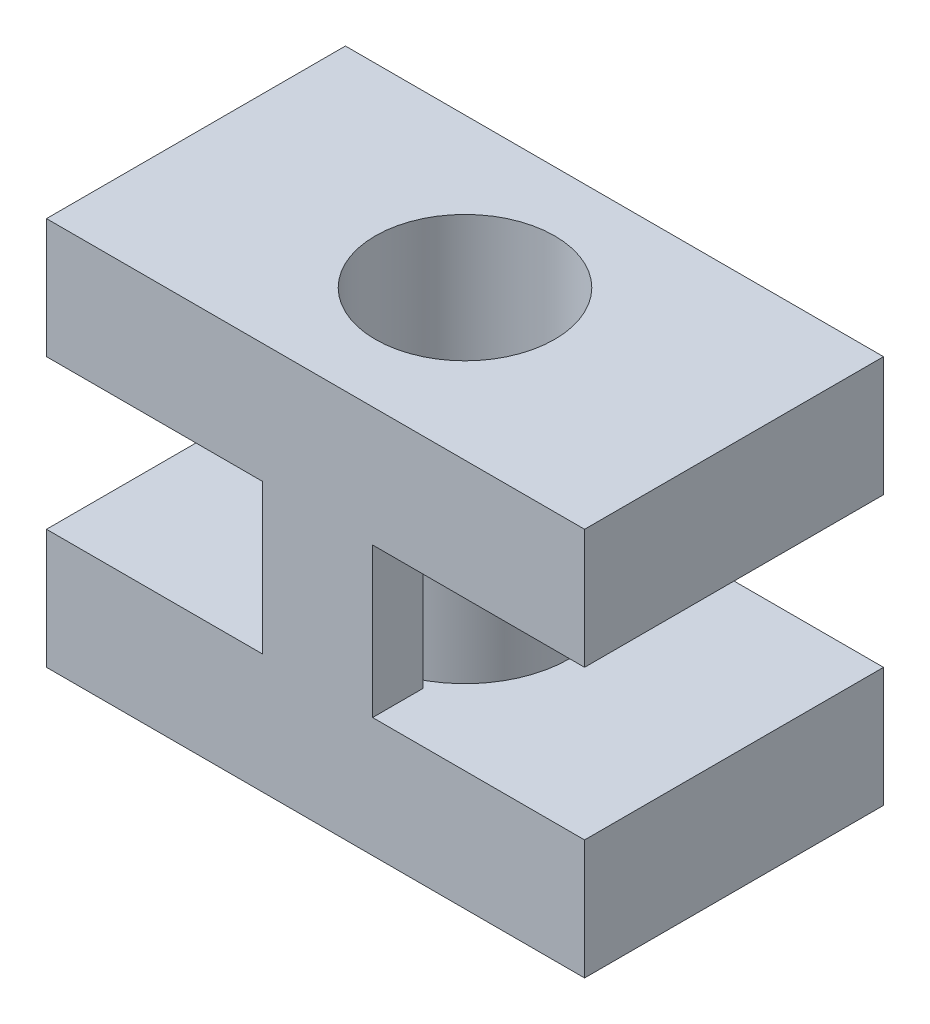
ISO-10303-21;
HEADER;
FILE_DESCRIPTION(('STEP AP214'),'2;1');
FILE_NAME('part.step','',(''),(''),'','','');
FILE_SCHEMA(('AUTOMOTIVE_DESIGN { 1 0 10303 214 1 1 1 1 }'));
ENDSEC;
DATA;
#1=APPLICATION_CONTEXT('core data for automotive mechanical design processes');
#2=APPLICATION_PROTOCOL_DEFINITION('international standard','automotive_design',2000,#1);
#3=PRODUCT_CONTEXT('',#1,'mechanical');
#4=PRODUCT('Part','Part','',(#3));
#5=PRODUCT_RELATED_PRODUCT_CATEGORY('part','',(#4));
#6=PRODUCT_DEFINITION_FORMATION('','',#4);
#7=PRODUCT_DEFINITION_CONTEXT('part definition',#1,'design');
#8=PRODUCT_DEFINITION('design','',#6,#7);
#9=PRODUCT_DEFINITION_SHAPE('','',#8);
#10=(LENGTH_UNIT() NAMED_UNIT(*) SI_UNIT(.MILLI.,.METRE.));
#11=(NAMED_UNIT(*) PLANE_ANGLE_UNIT() SI_UNIT($,.RADIAN.));
#12=(NAMED_UNIT(*) SI_UNIT($,.STERADIAN.) SOLID_ANGLE_UNIT());
#13=UNCERTAINTY_MEASURE_WITH_UNIT(LENGTH_MEASURE(1.E-05),#10,'distance_accuracy_value','');
#14=(GEOMETRIC_REPRESENTATION_CONTEXT(3) GLOBAL_UNCERTAINTY_ASSIGNED_CONTEXT((#13)) GLOBAL_UNIT_ASSIGNED_CONTEXT((#10,
#11,#12)) REPRESENTATION_CONTEXT('',''));
#15=CARTESIAN_POINT('',(0.,0.,0.));
#16=DIRECTION('',(0.,0.,1.));
#17=DIRECTION('',(1.,0.,0.));
#18=AXIS2_PLACEMENT_3D('',#15,#16,#17);
#19=CARTESIAN_POINT('',(0.,3.25,0.));
#20=DIRECTION('',(0.,-1.,0.));
#21=DIRECTION('',(0.,0.,-1.));
#22=AXIS2_PLACEMENT_3D('',#19,#20,#21);
#23=CYLINDRICAL_SURFACE('',#22,1.75);
#24=DIRECTION('',(0.,-1.,0.));
#25=VECTOR('',#24,1.);
#26=CARTESIAN_POINT('',(-0.560962770969429,3.25,1.65765520226201));
#27=LINE('',#26,#25);
#28=CARTESIAN_POINT('',(-0.560962770969429,1.25,1.65765520226201));
#29=VERTEX_POINT('',#28);
#30=CARTESIAN_POINT('',(-0.560962770969429,-1.25,1.65765520226201));
#31=VERTEX_POINT('',#30);
#32=EDGE_CURVE('E203',#29,#31,#27,.T.);
#33=ORIENTED_EDGE('',*,*,#32,.F.);
#34=CARTESIAN_POINT('',(0.,1.25,0.));
#35=DIRECTION('',(0.,1.,0.));
#36=DIRECTION('',(0.,0.,1.));
#37=AXIS2_PLACEMENT_3D('',#34,#35,#36);
#38=CIRCLE('',#37,1.75);
#39=CARTESIAN_POINT('',(-0.560962770969429,1.25,-1.65765520226201));
#40=VERTEX_POINT('',#39);
#41=EDGE_CURVE('E302',#40,#29,#38,.T.);
#42=ORIENTED_EDGE('',*,*,#41,.F.);
#43=DIRECTION('',(0.,-1.,0.));
#44=VECTOR('',#43,1.);
#45=CARTESIAN_POINT('',(-0.560962770969429,3.25,-1.65765520226201));
#46=LINE('',#45,#44);
#47=CARTESIAN_POINT('',(-0.560962770969429,-1.25,-1.65765520226201));
#48=VERTEX_POINT('',#47);
#49=EDGE_CURVE('E224',#48,#40,#46,.F.);
#50=ORIENTED_EDGE('',*,*,#49,.F.);
#51=CARTESIAN_POINT('',(0.,-1.25,0.));
#52=DIRECTION('',(0.,-1.,0.));
#53=DIRECTION('',(0.,0.,-1.));
#54=AXIS2_PLACEMENT_3D('',#51,#52,#53);
#55=CIRCLE('',#54,1.75);
#56=EDGE_CURVE('E40',#31,#48,#55,.T.);
#57=ORIENTED_EDGE('',*,*,#56,.F.);
#58=EDGE_LOOP('',(#33,#42,#50,#57));
#59=FACE_BOUND('',#58,.T.);
#60=ADVANCED_FACE('F32',(#59),#23,.T.);
#61=DIRECTION('',(0.,-1.,0.));
#62=VECTOR('',#61,1.);
#63=CARTESIAN_POINT('',(0.560962770969429,3.25,1.65765520226201));
#64=LINE('',#63,#62);
#65=CARTESIAN_POINT('',(0.560962770969429,-1.25,1.65765520226201));
#66=VERTEX_POINT('',#65);
#67=CARTESIAN_POINT('',(0.560962770969429,1.25,1.65765520226201));
#68=VERTEX_POINT('',#67);
#69=EDGE_CURVE('E200',#66,#68,#64,.F.);
#70=ORIENTED_EDGE('',*,*,#69,.F.);
#71=CARTESIAN_POINT('',(0.560962770969429,-1.25,-1.65765520226201));
#72=VERTEX_POINT('',#71);
#73=EDGE_CURVE('E11',#72,#66,#55,.T.);
#74=ORIENTED_EDGE('',*,*,#73,.F.);
#75=DIRECTION('',(0.,-1.,0.));
#76=VECTOR('',#75,1.);
#77=CARTESIAN_POINT('',(0.560962770969429,3.25,-1.65765520226201));
#78=LINE('',#77,#76);
#79=CARTESIAN_POINT('',(0.560962770969429,1.25,-1.65765520226201));
#80=VERTEX_POINT('',#79);
#81=EDGE_CURVE('E239',#80,#72,#78,.T.);
#82=ORIENTED_EDGE('',*,*,#81,.F.);
#83=EDGE_CURVE('E303',#68,#80,#38,.T.);
#84=ORIENTED_EDGE('',*,*,#83,.F.);
#85=EDGE_LOOP('',(#70,#74,#82,#84));
#86=FACE_BOUND('',#85,.T.);
#87=ADVANCED_FACE('F328',(#86),#23,.T.);
#88=CARTESIAN_POINT('',(0.,1.25,0.));
#89=DIRECTION('',(0.,1.,0.));
#90=DIRECTION('',(0.,0.,1.));
#91=AXIS2_PLACEMENT_3D('',#88,#89,#90);
#92=PLANE('',#91);
#93=DIRECTION('',(0.,0.,-1.));
#94=VECTOR('',#93,1.);
#95=CARTESIAN_POINT('',(0.954424960212918,1.25,2.5));
#96=LINE('',#95,#94);
#97=CARTESIAN_POINT('',(0.954424960212918,1.25,2.5));
#98=VERTEX_POINT('',#97);
#99=CARTESIAN_POINT('',(0.954424960212918,1.25,1.65765520226201));
#100=VERTEX_POINT('',#99);
#101=EDGE_CURVE('E48',#98,#100,#96,.T.);
#102=ORIENTED_EDGE('',*,*,#101,.T.);
#103=DIRECTION('',(-1.,0.,0.));
#104=VECTOR('',#103,1.);
#105=CARTESIAN_POINT('',(0.,1.25,1.65765520226201));
#106=LINE('',#105,#104);
#107=EDGE_CURVE('E346',#100,#68,#106,.T.);
#108=ORIENTED_EDGE('',*,*,#107,.T.);
#109=ORIENTED_EDGE('',*,*,#83,.T.);
#110=DIRECTION('',(1.,0.,0.));
#111=VECTOR('',#110,1.);
#112=CARTESIAN_POINT('',(0.,1.25,-1.65765520226201));
#113=LINE('',#112,#111);
#114=CARTESIAN_POINT('',(0.954424960212918,1.25,-1.65765520226201));
#115=VERTEX_POINT('',#114);
#116=EDGE_CURVE('E211',#80,#115,#113,.T.);
#117=ORIENTED_EDGE('',*,*,#116,.T.);
#118=DIRECTION('',(0.,0.,-1.));
#119=VECTOR('',#118,1.);
#120=CARTESIAN_POINT('',(0.954424960212918,1.25,-2.5));
#121=LINE('',#120,#119);
#122=CARTESIAN_POINT('',(0.954424960212918,1.25,-2.5));
#123=VERTEX_POINT('',#122);
#124=EDGE_CURVE('E225',#115,#123,#121,.T.);
#125=ORIENTED_EDGE('',*,*,#124,.T.);
#126=DIRECTION('',(-1.,0.,0.));
#127=VECTOR('',#126,1.);
#128=CARTESIAN_POINT('',(4.5,1.25,-2.5));
#129=LINE('',#128,#127);
#130=CARTESIAN_POINT('',(4.5,1.25,-2.5));
#131=VERTEX_POINT('',#130);
#132=EDGE_CURVE('E281',#131,#123,#129,.T.);
#133=ORIENTED_EDGE('',*,*,#132,.F.);
#134=DIRECTION('',(0.,0.,-1.));
#135=VECTOR('',#134,1.);
#136=CARTESIAN_POINT('',(4.5,1.25,2.5));
#137=LINE('',#136,#135);
#138=CARTESIAN_POINT('',(4.5,1.25,2.5));
#139=VERTEX_POINT('',#138);
#140=EDGE_CURVE('E277',#139,#131,#137,.T.);
#141=ORIENTED_EDGE('',*,*,#140,.F.);
#142=DIRECTION('',(1.,0.,0.));
#143=VECTOR('',#142,1.);
#144=CARTESIAN_POINT('',(4.5,1.25,2.5));
#145=LINE('',#144,#143);
#146=EDGE_CURVE('E272',#98,#139,#145,.T.);
#147=ORIENTED_EDGE('',*,*,#146,.F.);
#148=EDGE_LOOP('',(#102,#108,#109,#117,#125,#133,#141,#147));
#149=FACE_BOUND('',#148,.T.);
#150=ADVANCED_FACE('F333',(#149),#92,.F.);
#151=CARTESIAN_POINT('',(-0.890187656551689,1.25,1.65765520226201));
#152=VERTEX_POINT('',#151);
#153=EDGE_CURVE('E56',#29,#152,#106,.T.);
#154=ORIENTED_EDGE('',*,*,#153,.T.);
#155=DIRECTION('',(0.,0.,1.));
#156=VECTOR('',#155,1.);
#157=CARTESIAN_POINT('',(-0.890187656551689,1.25,1.65765520226201));
#158=LINE('',#157,#156);
#159=CARTESIAN_POINT('',(-0.890187656551689,1.25,2.5));
#160=VERTEX_POINT('',#159);
#161=EDGE_CURVE('E204',#152,#160,#158,.T.);
#162=ORIENTED_EDGE('',*,*,#161,.T.);
#163=CARTESIAN_POINT('',(-4.5,1.25,2.5));
#164=VERTEX_POINT('',#163);
#165=EDGE_CURVE('E274',#164,#160,#145,.T.);
#166=ORIENTED_EDGE('',*,*,#165,.F.);
#167=DIRECTION('',(0.,0.,1.));
#168=VECTOR('',#167,1.);
#169=CARTESIAN_POINT('',(-4.5,1.25,2.5));
#170=LINE('',#169,#168);
#171=CARTESIAN_POINT('',(-4.5,1.25,-2.5));
#172=VERTEX_POINT('',#171);
#173=EDGE_CURVE('E269',#172,#164,#170,.T.);
#174=ORIENTED_EDGE('',*,*,#173,.F.);
#175=CARTESIAN_POINT('',(-0.890187656551689,1.25,-2.5));
#176=VERTEX_POINT('',#175);
#177=EDGE_CURVE('E280',#176,#172,#129,.T.);
#178=ORIENTED_EDGE('',*,*,#177,.F.);
#179=DIRECTION('',(0.,0.,1.));
#180=VECTOR('',#179,1.);
#181=CARTESIAN_POINT('',(-0.890187656551689,1.25,-1.65765520226201));
#182=LINE('',#181,#180);
#183=CARTESIAN_POINT('',(-0.890187656551689,1.25,-1.65765520226201));
#184=VERTEX_POINT('',#183);
#185=EDGE_CURVE('E222',#176,#184,#182,.T.);
#186=ORIENTED_EDGE('',*,*,#185,.T.);
#187=EDGE_CURVE('E227',#184,#40,#113,.T.);
#188=ORIENTED_EDGE('',*,*,#187,.T.);
#189=ORIENTED_EDGE('',*,*,#41,.T.);
#190=EDGE_LOOP('',(#154,#162,#166,#174,#178,#186,#188,#189));
#191=FACE_BOUND('',#190,.T.);
#192=ADVANCED_FACE('F340',(#191),#92,.F.);
#193=CARTESIAN_POINT('',(0.,-1.25,0.));
#194=DIRECTION('',(0.,-1.,0.));
#195=DIRECTION('',(0.,0.,1.));
#196=AXIS2_PLACEMENT_3D('',#193,#194,#195);
#197=PLANE('',#196);
#198=DIRECTION('',(0.,0.,-1.));
#199=VECTOR('',#198,1.);
#200=CARTESIAN_POINT('',(0.954424960212918,-1.25,2.5));
#201=LINE('',#200,#199);
#202=CARTESIAN_POINT('',(0.954424960212918,-1.25,2.5));
#203=VERTEX_POINT('',#202);
#204=CARTESIAN_POINT('',(0.954424960212918,-1.25,1.65765520226201));
#205=VERTEX_POINT('',#204);
#206=EDGE_CURVE('E185',#203,#205,#201,.T.);
#207=ORIENTED_EDGE('',*,*,#206,.F.);
#208=DIRECTION('',(1.,0.,0.));
#209=VECTOR('',#208,1.);
#210=CARTESIAN_POINT('',(4.5,-1.25,2.5));
#211=LINE('',#210,#209);
#212=CARTESIAN_POINT('',(4.5,-1.25,2.5));
#213=VERTEX_POINT('',#212);
#214=EDGE_CURVE('E171',#203,#213,#211,.T.);
#215=ORIENTED_EDGE('',*,*,#214,.T.);
#216=DIRECTION('',(0.,0.,-1.));
#217=VECTOR('',#216,1.);
#218=CARTESIAN_POINT('',(4.5,-1.25,2.5));
#219=LINE('',#218,#217);
#220=CARTESIAN_POINT('',(4.5,-1.25,-2.5));
#221=VERTEX_POINT('',#220);
#222=EDGE_CURVE('E182',#213,#221,#219,.T.);
#223=ORIENTED_EDGE('',*,*,#222,.T.);
#224=DIRECTION('',(-1.,0.,0.));
#225=VECTOR('',#224,1.);
#226=CARTESIAN_POINT('',(4.5,-1.25,-2.5));
#227=LINE('',#226,#225);
#228=CARTESIAN_POINT('',(0.954424960212918,-1.25,-2.5));
#229=VERTEX_POINT('',#228);
#230=EDGE_CURVE('E248',#221,#229,#227,.T.);
#231=ORIENTED_EDGE('',*,*,#230,.T.);
#232=DIRECTION('',(0.,0.,-1.));
#233=VECTOR('',#232,1.);
#234=CARTESIAN_POINT('',(0.954424960212918,-1.25,-2.5));
#235=LINE('',#234,#233);
#236=CARTESIAN_POINT('',(0.954424960212918,-1.25,-1.65765520226201));
#237=VERTEX_POINT('',#236);
#238=EDGE_CURVE('E218',#237,#229,#235,.T.);
#239=ORIENTED_EDGE('',*,*,#238,.F.);
#240=DIRECTION('',(1.,0.,0.));
#241=VECTOR('',#240,1.);
#242=CARTESIAN_POINT('',(0.,-1.25,-1.65765520226201));
#243=LINE('',#242,#241);
#244=EDGE_CURVE('E212',#72,#237,#243,.T.);
#245=ORIENTED_EDGE('',*,*,#244,.F.);
#246=ORIENTED_EDGE('',*,*,#73,.T.);
#247=DIRECTION('',(-1.,0.,0.));
#248=VECTOR('',#247,1.);
#249=CARTESIAN_POINT('',(0.,-1.25,1.65765520226201));
#250=LINE('',#249,#248);
#251=EDGE_CURVE('E188',#205,#66,#250,.T.);
#252=ORIENTED_EDGE('',*,*,#251,.F.);
#253=EDGE_LOOP('',(#207,#215,#223,#231,#239,#245,#246,#252));
#254=FACE_BOUND('',#253,.T.);
#255=ADVANCED_FACE('F186',(#254),#197,.F.);
#256=CARTESIAN_POINT('',(-0.890187656551689,-1.25,1.65765520226201));
#257=VERTEX_POINT('',#256);
#258=EDGE_CURVE('E351',#31,#257,#250,.T.);
#259=ORIENTED_EDGE('',*,*,#258,.F.);
#260=ORIENTED_EDGE('',*,*,#56,.T.);
#261=CARTESIAN_POINT('',(-0.890187656551689,-1.25,-1.65765520226201));
#262=VERTEX_POINT('',#261);
#263=EDGE_CURVE('E208',#262,#48,#243,.T.);
#264=ORIENTED_EDGE('',*,*,#263,.F.);
#265=DIRECTION('',(0.,0.,1.));
#266=VECTOR('',#265,1.);
#267=CARTESIAN_POINT('',(-0.890187656551689,-1.25,-1.65765520226201));
#268=LINE('',#267,#266);
#269=CARTESIAN_POINT('',(-0.890187656551689,-1.25,-2.5));
#270=VERTEX_POINT('',#269);
#271=EDGE_CURVE('E213',#270,#262,#268,.T.);
#272=ORIENTED_EDGE('',*,*,#271,.F.);
#273=CARTESIAN_POINT('',(-4.5,-1.25,-2.5));
#274=VERTEX_POINT('',#273);
#275=EDGE_CURVE('E246',#270,#274,#227,.T.);
#276=ORIENTED_EDGE('',*,*,#275,.T.);
#277=DIRECTION('',(0.,0.,1.));
#278=VECTOR('',#277,1.);
#279=CARTESIAN_POINT('',(-4.5,-1.25,2.5));
#280=LINE('',#279,#278);
#281=CARTESIAN_POINT('',(-4.5,-1.25,2.5));
#282=VERTEX_POINT('',#281);
#283=EDGE_CURVE('E243',#274,#282,#280,.T.);
#284=ORIENTED_EDGE('',*,*,#283,.T.);
#285=CARTESIAN_POINT('',(-0.890187656551689,-1.25,2.5));
#286=VERTEX_POINT('',#285);
#287=EDGE_CURVE('E181',#282,#286,#211,.T.);
#288=ORIENTED_EDGE('',*,*,#287,.T.);
#289=DIRECTION('',(0.,0.,1.));
#290=VECTOR('',#289,1.);
#291=CARTESIAN_POINT('',(-0.890187656551689,-1.25,1.65765520226201));
#292=LINE('',#291,#290);
#293=EDGE_CURVE('E352',#257,#286,#292,.T.);
#294=ORIENTED_EDGE('',*,*,#293,.F.);
#295=EDGE_LOOP('',(#259,#260,#264,#272,#276,#284,#288,#294));
#296=FACE_BOUND('',#295,.T.);
#297=ADVANCED_FACE('F359',(#296),#197,.F.);
#298=CARTESIAN_POINT('',(0.,3.25,0.));
#299=DIRECTION('',(0.,1.,0.));
#300=DIRECTION('',(0.,0.,1.));
#301=AXIS2_PLACEMENT_3D('',#298,#299,#300);
#302=PLANE('',#301);
#303=CARTESIAN_POINT('',(0.,3.25,0.));
#304=DIRECTION('',(0.,1.,0.));
#305=DIRECTION('',(0.,0.,1.));
#306=AXIS2_PLACEMENT_3D('',#303,#304,#305);
#307=CIRCLE('',#306,1.5);
#308=CARTESIAN_POINT('',(0.,3.25,1.5));
#309=VERTEX_POINT('',#308);
#310=EDGE_CURVE('E304',#309,#309,#307,.T.);
#311=ORIENTED_EDGE('',*,*,#310,.F.);
#312=EDGE_LOOP('',(#311));
#313=FACE_BOUND('',#312,.T.);
#314=DIRECTION('',(0.,0.,1.));
#315=VECTOR('',#314,1.);
#316=CARTESIAN_POINT('',(-4.5,3.25,2.5));
#317=LINE('',#316,#315);
#318=CARTESIAN_POINT('',(-4.5,3.25,-2.5));
#319=VERTEX_POINT('',#318);
#320=CARTESIAN_POINT('',(-4.5,3.25,2.5));
#321=VERTEX_POINT('',#320);
#322=EDGE_CURVE('E262',#319,#321,#317,.T.);
#323=ORIENTED_EDGE('',*,*,#322,.T.);
#324=DIRECTION('',(1.,0.,0.));
#325=VECTOR('',#324,1.);
#326=CARTESIAN_POINT('',(4.5,3.25,2.5));
#327=LINE('',#326,#325);
#328=CARTESIAN_POINT('',(4.5,3.25,2.5));
#329=VERTEX_POINT('',#328);
#330=EDGE_CURVE('E287',#321,#329,#327,.T.);
#331=ORIENTED_EDGE('',*,*,#330,.T.);
#332=DIRECTION('',(0.,0.,-1.));
#333=VECTOR('',#332,1.);
#334=CARTESIAN_POINT('',(4.5,3.25,2.5));
#335=LINE('',#334,#333);
#336=CARTESIAN_POINT('',(4.5,3.25,-2.5));
#337=VERTEX_POINT('',#336);
#338=EDGE_CURVE('E290',#329,#337,#335,.T.);
#339=ORIENTED_EDGE('',*,*,#338,.T.);
#340=DIRECTION('',(-1.,0.,0.));
#341=VECTOR('',#340,1.);
#342=CARTESIAN_POINT('',(4.5,3.25,-2.5));
#343=LINE('',#342,#341);
#344=EDGE_CURVE('E273',#337,#319,#343,.T.);
#345=ORIENTED_EDGE('',*,*,#344,.T.);
#346=EDGE_LOOP('',(#323,#331,#339,#345));
#347=FACE_BOUND('',#346,.T.);
#348=ADVANCED_FACE('F325',(#313,#347),#302,.T.);
#349=CARTESIAN_POINT('',(0.,-3.25,0.));
#350=DIRECTION('',(0.,1.,0.));
#351=DIRECTION('',(0.,0.,1.));
#352=AXIS2_PLACEMENT_3D('',#349,#350,#351);
#353=PLANE('',#352);
#354=CARTESIAN_POINT('',(0.,-3.25,0.));
#355=DIRECTION('',(0.,1.,0.));
#356=DIRECTION('',(0.,0.,1.));
#357=AXIS2_PLACEMENT_3D('',#354,#355,#356);
#358=CIRCLE('',#357,1.5);
#359=CARTESIAN_POINT('',(0.,-3.25,1.5));
#360=VERTEX_POINT('',#359);
#361=EDGE_CURVE('E35',#360,#360,#358,.T.);
#362=ORIENTED_EDGE('',*,*,#361,.T.);
#363=EDGE_LOOP('',(#362));
#364=FACE_BOUND('',#363,.T.);
#365=DIRECTION('',(0.,0.,1.));
#366=VECTOR('',#365,1.);
#367=CARTESIAN_POINT('',(-4.5,-3.25,2.5));
#368=LINE('',#367,#366);
#369=CARTESIAN_POINT('',(-4.5,-3.25,-2.5));
#370=VERTEX_POINT('',#369);
#371=CARTESIAN_POINT('',(-4.5,-3.25,2.5));
#372=VERTEX_POINT('',#371);
#373=EDGE_CURVE('E242',#370,#372,#368,.T.);
#374=ORIENTED_EDGE('',*,*,#373,.F.);
#375=DIRECTION('',(-1.,0.,0.));
#376=VECTOR('',#375,1.);
#377=CARTESIAN_POINT('',(4.5,-3.25,-2.5));
#378=LINE('',#377,#376);
#379=CARTESIAN_POINT('',(4.5,-3.25,-2.5));
#380=VERTEX_POINT('',#379);
#381=EDGE_CURVE('E254',#380,#370,#378,.T.);
#382=ORIENTED_EDGE('',*,*,#381,.F.);
#383=DIRECTION('',(0.,0.,-1.));
#384=VECTOR('',#383,1.);
#385=CARTESIAN_POINT('',(4.5,-3.25,2.5));
#386=LINE('',#385,#384);
#387=CARTESIAN_POINT('',(4.5,-3.25,2.5));
#388=VERTEX_POINT('',#387);
#389=EDGE_CURVE('E256',#388,#380,#386,.T.);
#390=ORIENTED_EDGE('',*,*,#389,.F.);
#391=DIRECTION('',(1.,0.,0.));
#392=VECTOR('',#391,1.);
#393=CARTESIAN_POINT('',(4.5,-3.25,2.5));
#394=LINE('',#393,#392);
#395=EDGE_CURVE('E247',#372,#388,#394,.T.);
#396=ORIENTED_EDGE('',*,*,#395,.F.);
#397=EDGE_LOOP('',(#374,#382,#390,#396));
#398=FACE_BOUND('',#397,.T.);
#399=ADVANCED_FACE('F311',(#364,#398),#353,.F.);
#400=CARTESIAN_POINT('',(0.,3.25,0.));
#401=DIRECTION('',(0.,-1.,0.));
#402=DIRECTION('',(0.,0.,-1.));
#403=AXIS2_PLACEMENT_3D('',#400,#401,#402);
#404=CYLINDRICAL_SURFACE('',#403,1.5);
#405=ORIENTED_EDGE('',*,*,#361,.F.);
#406=EDGE_LOOP('',(#405));
#407=FACE_BOUND('',#406,.T.);
#408=ORIENTED_EDGE('',*,*,#310,.T.);
#409=EDGE_LOOP('',(#408));
#410=FACE_BOUND('',#409,.T.);
#411=ADVANCED_FACE('F314',(#407,#410),#404,.F.);
#412=CARTESIAN_POINT('',(-4.5,1.25,2.5));
#413=DIRECTION('',(-1.,0.,0.));
#414=DIRECTION('',(0.,0.,1.));
#415=AXIS2_PLACEMENT_3D('',#412,#413,#414);
#416=PLANE('',#415);
#417=ORIENTED_EDGE('',*,*,#322,.F.);
#418=DIRECTION('',(0.,1.,0.));
#419=VECTOR('',#418,1.);
#420=CARTESIAN_POINT('',(-4.5,1.25,-2.5));
#421=LINE('',#420,#419);
#422=EDGE_CURVE('E295',#172,#319,#421,.T.);
#423=ORIENTED_EDGE('',*,*,#422,.F.);
#424=ORIENTED_EDGE('',*,*,#173,.T.);
#425=DIRECTION('',(0.,1.,0.));
#426=VECTOR('',#425,1.);
#427=CARTESIAN_POINT('',(-4.5,1.25,2.5));
#428=LINE('',#427,#426);
#429=EDGE_CURVE('E284',#164,#321,#428,.T.);
#430=ORIENTED_EDGE('',*,*,#429,.T.);
#431=EDGE_LOOP('',(#417,#423,#424,#430));
#432=FACE_BOUND('',#431,.T.);
#433=ADVANCED_FACE('F316',(#432),#416,.T.);
#434=CARTESIAN_POINT('',(4.5,1.25,-2.5));
#435=DIRECTION('',(0.,0.,-1.));
#436=DIRECTION('',(-1.,0.,0.));
#437=AXIS2_PLACEMENT_3D('',#434,#435,#436);
#438=PLANE('',#437);
#439=ORIENTED_EDGE('',*,*,#344,.F.);
#440=DIRECTION('',(0.,1.,0.));
#441=VECTOR('',#440,1.);
#442=CARTESIAN_POINT('',(4.5,1.25,-2.5));
#443=LINE('',#442,#441);
#444=EDGE_CURVE('E297',#131,#337,#443,.T.);
#445=ORIENTED_EDGE('',*,*,#444,.F.);
#446=ORIENTED_EDGE('',*,*,#132,.T.);
#447=DIRECTION('',(0.,-1.,0.));
#448=VECTOR('',#447,1.);
#449=CARTESIAN_POINT('',(0.954424960212918,3.27784133112121,-2.5));
#450=LINE('',#449,#448);
#451=EDGE_CURVE('E221',#123,#229,#450,.T.);
#452=ORIENTED_EDGE('',*,*,#451,.T.);
#453=ORIENTED_EDGE('',*,*,#230,.F.);
#454=DIRECTION('',(0.,-1.,0.));
#455=VECTOR('',#454,1.);
#456=CARTESIAN_POINT('',(4.5,-1.25,-2.5));
#457=LINE('',#456,#455);
#458=EDGE_CURVE('E264',#221,#380,#457,.T.);
#459=ORIENTED_EDGE('',*,*,#458,.T.);
#460=ORIENTED_EDGE('',*,*,#381,.T.);
#461=DIRECTION('',(0.,-1.,0.));
#462=VECTOR('',#461,1.);
#463=CARTESIAN_POINT('',(-4.5,-1.25,-2.5));
#464=LINE('',#463,#462);
#465=EDGE_CURVE('E251',#274,#370,#464,.T.);
#466=ORIENTED_EDGE('',*,*,#465,.F.);
#467=ORIENTED_EDGE('',*,*,#275,.F.);
#468=DIRECTION('',(0.,-1.,0.));
#469=VECTOR('',#468,1.);
#470=CARTESIAN_POINT('',(-0.890187656551689,3.27784133112121,-2.5));
#471=LINE('',#470,#469);
#472=EDGE_CURVE('E217',#176,#270,#471,.T.);
#473=ORIENTED_EDGE('',*,*,#472,.F.);
#474=ORIENTED_EDGE('',*,*,#177,.T.);
#475=ORIENTED_EDGE('',*,*,#422,.T.);
#476=EDGE_LOOP('',(#439,#445,#446,#452,#453,#459,#460,#466,#467,#473,#474,#475));
#477=FACE_BOUND('',#476,.T.);
#478=ADVANCED_FACE('F322',(#477),#438,.T.);
#479=CARTESIAN_POINT('',(4.5,1.25,2.5));
#480=DIRECTION('',(1.,0.,0.));
#481=DIRECTION('',(0.,0.,-1.));
#482=AXIS2_PLACEMENT_3D('',#479,#480,#481);
#483=PLANE('',#482);
#484=ORIENTED_EDGE('',*,*,#338,.F.);
#485=DIRECTION('',(0.,1.,0.));
#486=VECTOR('',#485,1.);
#487=CARTESIAN_POINT('',(4.5,1.25,2.5));
#488=LINE('',#487,#486);
#489=EDGE_CURVE('E299',#139,#329,#488,.T.);
#490=ORIENTED_EDGE('',*,*,#489,.F.);
#491=ORIENTED_EDGE('',*,*,#140,.T.);
#492=ORIENTED_EDGE('',*,*,#444,.T.);
#493=EDGE_LOOP('',(#484,#490,#491,#492));
#494=FACE_BOUND('',#493,.T.);
#495=ADVANCED_FACE('F407',(#494),#483,.T.);
#496=CARTESIAN_POINT('',(4.5,1.25,2.5));
#497=DIRECTION('',(0.,0.,1.));
#498=DIRECTION('',(1.,0.,0.));
#499=AXIS2_PLACEMENT_3D('',#496,#497,#498);
#500=PLANE('',#499);
#501=ORIENTED_EDGE('',*,*,#330,.F.);
#502=ORIENTED_EDGE('',*,*,#429,.F.);
#503=ORIENTED_EDGE('',*,*,#165,.T.);
#504=DIRECTION('',(0.,-1.,0.));
#505=VECTOR('',#504,1.);
#506=CARTESIAN_POINT('',(-0.890187656551689,3.27784133112121,2.5));
#507=LINE('',#506,#505);
#508=EDGE_CURVE('E198',#160,#286,#507,.T.);
#509=ORIENTED_EDGE('',*,*,#508,.T.);
#510=ORIENTED_EDGE('',*,*,#287,.F.);
#511=DIRECTION('',(0.,-1.,0.));
#512=VECTOR('',#511,1.);
#513=CARTESIAN_POINT('',(-4.5,-1.25,2.5));
#514=LINE('',#513,#512);
#515=EDGE_CURVE('E259',#282,#372,#514,.T.);
#516=ORIENTED_EDGE('',*,*,#515,.T.);
#517=ORIENTED_EDGE('',*,*,#395,.T.);
#518=DIRECTION('',(0.,-1.,0.));
#519=VECTOR('',#518,1.);
#520=CARTESIAN_POINT('',(4.5,-1.25,2.5));
#521=LINE('',#520,#519);
#522=EDGE_CURVE('E178',#213,#388,#521,.T.);
#523=ORIENTED_EDGE('',*,*,#522,.F.);
#524=ORIENTED_EDGE('',*,*,#214,.F.);
#525=DIRECTION('',(0.,-1.,0.));
#526=VECTOR('',#525,1.);
#527=CARTESIAN_POINT('',(0.954424960212918,3.27784133112121,2.5));
#528=LINE('',#527,#526);
#529=EDGE_CURVE('E176',#98,#203,#528,.T.);
#530=ORIENTED_EDGE('',*,*,#529,.F.);
#531=ORIENTED_EDGE('',*,*,#146,.T.);
#532=ORIENTED_EDGE('',*,*,#489,.T.);
#533=EDGE_LOOP('',(#501,#502,#503,#509,#510,#516,#517,#523,#524,#530,#531,#532));
#534=FACE_BOUND('',#533,.T.);
#535=ADVANCED_FACE('F174',(#534),#500,.T.);
#536=CARTESIAN_POINT('',(-4.5,-1.25,2.5));
#537=DIRECTION('',(1.,0.,0.));
#538=DIRECTION('',(0.,0.,-1.));
#539=AXIS2_PLACEMENT_3D('',#536,#537,#538);
#540=PLANE('',#539);
#541=ORIENTED_EDGE('',*,*,#373,.T.);
#542=ORIENTED_EDGE('',*,*,#515,.F.);
#543=ORIENTED_EDGE('',*,*,#283,.F.);
#544=ORIENTED_EDGE('',*,*,#465,.T.);
#545=EDGE_LOOP('',(#541,#542,#543,#544));
#546=FACE_BOUND('',#545,.T.);
#547=ADVANCED_FACE('F383',(#546),#540,.F.);
#548=CARTESIAN_POINT('',(4.5,-1.25,2.5));
#549=DIRECTION('',(-1.,0.,0.));
#550=DIRECTION('',(0.,0.,1.));
#551=AXIS2_PLACEMENT_3D('',#548,#549,#550);
#552=PLANE('',#551);
#553=ORIENTED_EDGE('',*,*,#389,.T.);
#554=ORIENTED_EDGE('',*,*,#458,.F.);
#555=ORIENTED_EDGE('',*,*,#222,.F.);
#556=ORIENTED_EDGE('',*,*,#522,.T.);
#557=EDGE_LOOP('',(#553,#554,#555,#556));
#558=FACE_BOUND('',#557,.T.);
#559=ADVANCED_FACE('F386',(#558),#552,.F.);
#560=CARTESIAN_POINT('',(0.,3.27784133112121,-1.65765520226201));
#561=DIRECTION('',(0.,0.,-1.));
#562=DIRECTION('',(-1.,0.,0.));
#563=AXIS2_PLACEMENT_3D('',#560,#561,#562);
#564=PLANE('',#563);
#565=ORIENTED_EDGE('',*,*,#116,.F.);
#566=ORIENTED_EDGE('',*,*,#81,.T.);
#567=ORIENTED_EDGE('',*,*,#244,.T.);
#568=DIRECTION('',(0.,-1.,0.));
#569=VECTOR('',#568,1.);
#570=CARTESIAN_POINT('',(0.954424960212918,3.27784133112121,-1.65765520226201));
#571=LINE('',#570,#569);
#572=EDGE_CURVE('E207',#115,#237,#571,.T.);
#573=ORIENTED_EDGE('',*,*,#572,.F.);
#574=EDGE_LOOP('',(#565,#566,#567,#573));
#575=FACE_BOUND('',#574,.T.);
#576=ADVANCED_FACE('F398',(#575),#564,.F.);
#577=ORIENTED_EDGE('',*,*,#263,.T.);
#578=ORIENTED_EDGE('',*,*,#49,.T.);
#579=ORIENTED_EDGE('',*,*,#187,.F.);
#580=DIRECTION('',(0.,-1.,0.));
#581=VECTOR('',#580,1.);
#582=CARTESIAN_POINT('',(-0.890187656551689,3.27784133112121,-1.65765520226201));
#583=LINE('',#582,#581);
#584=EDGE_CURVE('E216',#184,#262,#583,.T.);
#585=ORIENTED_EDGE('',*,*,#584,.T.);
#586=EDGE_LOOP('',(#577,#578,#579,#585));
#587=FACE_BOUND('',#586,.T.);
#588=ADVANCED_FACE('F376',(#587),#564,.F.);
#589=CARTESIAN_POINT('',(0.954424960212918,3.27784133112121,-2.5));
#590=DIRECTION('',(-1.,0.,0.));
#591=DIRECTION('',(0.,0.,1.));
#592=AXIS2_PLACEMENT_3D('',#589,#590,#591);
#593=PLANE('',#592);
#594=ORIENTED_EDGE('',*,*,#124,.F.);
#595=ORIENTED_EDGE('',*,*,#572,.T.);
#596=ORIENTED_EDGE('',*,*,#238,.T.);
#597=ORIENTED_EDGE('',*,*,#451,.F.);
#598=EDGE_LOOP('',(#594,#595,#596,#597));
#599=FACE_BOUND('',#598,.T.);
#600=ADVANCED_FACE('F394',(#599),#593,.F.);
#601=CARTESIAN_POINT('',(-0.890187656551689,3.27784133112121,-1.65765520226201));
#602=DIRECTION('',(1.,0.,0.));
#603=DIRECTION('',(0.,0.,-1.));
#604=AXIS2_PLACEMENT_3D('',#601,#602,#603);
#605=PLANE('',#604);
#606=ORIENTED_EDGE('',*,*,#185,.F.);
#607=ORIENTED_EDGE('',*,*,#472,.T.);
#608=ORIENTED_EDGE('',*,*,#271,.T.);
#609=ORIENTED_EDGE('',*,*,#584,.F.);
#610=EDGE_LOOP('',(#606,#607,#608,#609));
#611=FACE_BOUND('',#610,.T.);
#612=ADVANCED_FACE('F373',(#611),#605,.F.);
#613=CARTESIAN_POINT('',(0.,3.27784133112121,1.65765520226201));
#614=DIRECTION('',(0.,0.,1.));
#615=DIRECTION('',(1.,0.,0.));
#616=AXIS2_PLACEMENT_3D('',#613,#614,#615);
#617=PLANE('',#616);
#618=ORIENTED_EDGE('',*,*,#153,.F.);
#619=ORIENTED_EDGE('',*,*,#32,.T.);
#620=ORIENTED_EDGE('',*,*,#258,.T.);
#621=DIRECTION('',(0.,-1.,0.));
#622=VECTOR('',#621,1.);
#623=CARTESIAN_POINT('',(-0.890187656551689,3.27784133112121,1.65765520226201));
#624=LINE('',#623,#622);
#625=EDGE_CURVE('E345',#152,#257,#624,.T.);
#626=ORIENTED_EDGE('',*,*,#625,.F.);
#627=EDGE_LOOP('',(#618,#619,#620,#626));
#628=FACE_BOUND('',#627,.T.);
#629=ADVANCED_FACE('F343',(#628),#617,.F.);
#630=ORIENTED_EDGE('',*,*,#251,.T.);
#631=ORIENTED_EDGE('',*,*,#69,.T.);
#632=ORIENTED_EDGE('',*,*,#107,.F.);
#633=DIRECTION('',(0.,-1.,0.));
#634=VECTOR('',#633,1.);
#635=CARTESIAN_POINT('',(0.954424960212918,3.27784133112121,1.65765520226201));
#636=LINE('',#635,#634);
#637=EDGE_CURVE('E192',#100,#205,#636,.T.);
#638=ORIENTED_EDGE('',*,*,#637,.T.);
#639=EDGE_LOOP('',(#630,#631,#632,#638));
#640=FACE_BOUND('',#639,.T.);
#641=ADVANCED_FACE('F402',(#640),#617,.F.);
#642=CARTESIAN_POINT('',(0.954424960212918,3.27784133112121,2.5));
#643=DIRECTION('',(-1.,0.,0.));
#644=DIRECTION('',(0.,0.,1.));
#645=AXIS2_PLACEMENT_3D('',#642,#643,#644);
#646=PLANE('',#645);
#647=ORIENTED_EDGE('',*,*,#101,.F.);
#648=ORIENTED_EDGE('',*,*,#529,.T.);
#649=ORIENTED_EDGE('',*,*,#206,.T.);
#650=ORIENTED_EDGE('',*,*,#637,.F.);
#651=EDGE_LOOP('',(#647,#648,#649,#650));
#652=FACE_BOUND('',#651,.T.);
#653=ADVANCED_FACE('F194',(#652),#646,.F.);
#654=CARTESIAN_POINT('',(-0.890187656551689,3.27784133112121,1.65765520226201));
#655=DIRECTION('',(1.,0.,0.));
#656=DIRECTION('',(0.,0.,-1.));
#657=AXIS2_PLACEMENT_3D('',#654,#655,#656);
#658=PLANE('',#657);
#659=ORIENTED_EDGE('',*,*,#161,.F.);
#660=ORIENTED_EDGE('',*,*,#625,.T.);
#661=ORIENTED_EDGE('',*,*,#293,.T.);
#662=ORIENTED_EDGE('',*,*,#508,.F.);
#663=EDGE_LOOP('',(#659,#660,#661,#662));
#664=FACE_BOUND('',#663,.T.);
#665=ADVANCED_FACE('F362',(#664),#658,.F.);
#666=CLOSED_SHELL('',(#60,#87,#150,#192,#255,#297,#348,#399,#411,#433,#478,#495,#535,#547,#559,
#576,#588,#600,#612,#629,#641,#653,#665));
#667=MANIFOLD_SOLID_BREP('B2',#666);
#668=ADVANCED_BREP_SHAPE_REPRESENTATION('',(#18,#667),#14);
#669=SHAPE_DEFINITION_REPRESENTATION(#9,#668);
ENDSEC;
END-ISO-10303-21;
